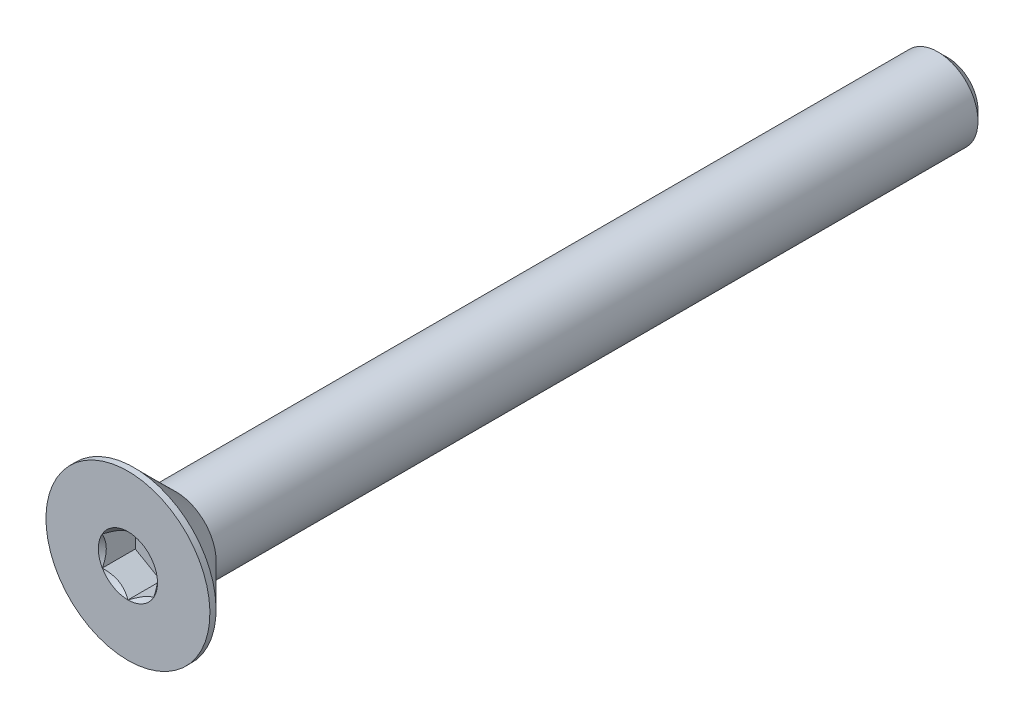
ISO-10303-21;
HEADER;
FILE_DESCRIPTION(('STEP AP214'),'2;1');
FILE_NAME('part.step','',(''),(''),'','','');
FILE_SCHEMA(('AUTOMOTIVE_DESIGN { 1 0 10303 214 1 1 1 1 }'));
ENDSEC;
DATA;
#1=APPLICATION_CONTEXT('core data for automotive mechanical design processes');
#2=APPLICATION_PROTOCOL_DEFINITION('international standard','automotive_design',2000,#1);
#3=PRODUCT_CONTEXT('',#1,'mechanical');
#4=PRODUCT('Part','Part','',(#3));
#5=PRODUCT_RELATED_PRODUCT_CATEGORY('part','',(#4));
#6=PRODUCT_DEFINITION_FORMATION('','',#4);
#7=PRODUCT_DEFINITION_CONTEXT('part definition',#1,'design');
#8=PRODUCT_DEFINITION('design','',#6,#7);
#9=PRODUCT_DEFINITION_SHAPE('','',#8);
#10=(LENGTH_UNIT() NAMED_UNIT(*) SI_UNIT(.MILLI.,.METRE.));
#11=(NAMED_UNIT(*) PLANE_ANGLE_UNIT() SI_UNIT($,.RADIAN.));
#12=(NAMED_UNIT(*) SI_UNIT($,.STERADIAN.) SOLID_ANGLE_UNIT());
#13=UNCERTAINTY_MEASURE_WITH_UNIT(LENGTH_MEASURE(1.E-05),#10,'distance_accuracy_value','');
#14=(GEOMETRIC_REPRESENTATION_CONTEXT(3) GLOBAL_UNCERTAINTY_ASSIGNED_CONTEXT((#13)) GLOBAL_UNIT_ASSIGNED_CONTEXT((#10,
#11,#12)) REPRESENTATION_CONTEXT('',''));
#15=CARTESIAN_POINT('',(0.,0.,0.));
#16=DIRECTION('',(0.,0.,1.));
#17=DIRECTION('',(1.,0.,0.));
#18=AXIS2_PLACEMENT_3D('',#15,#16,#17);
#19=CARTESIAN_POINT('',(1.25,-0.721687836487033,-1.61));
#20=DIRECTION('',(0.,0.,1.));
#21=DIRECTION('',(1.,0.,0.));
#22=AXIS2_PLACEMENT_3D('',#19,#20,#21);
#23=PLANE('',#22);
#24=DIRECTION('',(0.,1.,0.));
#25=VECTOR('',#24,1.);
#26=CARTESIAN_POINT('',(-1.25,0.721687836487033,-1.61));
#27=LINE('',#26,#25);
#28=CARTESIAN_POINT('',(-1.25,0.721687836487032,-1.61));
#29=VERTEX_POINT('',#28);
#30=CARTESIAN_POINT('',(-1.25,-0.721687836487031,-1.61));
#31=VERTEX_POINT('',#30);
#32=EDGE_CURVE('E83',#29,#31,#27,.F.);
#33=ORIENTED_EDGE('',*,*,#32,.T.);
#34=DIRECTION('',(0.866025403784439,-0.5,0.));
#35=VECTOR('',#34,1.);
#36=CARTESIAN_POINT('',(-1.25,-0.721687836487031,-1.61));
#37=LINE('',#36,#35);
#38=CARTESIAN_POINT('',(0.,-1.44337567297406,-1.61));
#39=VERTEX_POINT('',#38);
#40=EDGE_CURVE('E85',#31,#39,#37,.T.);
#41=ORIENTED_EDGE('',*,*,#40,.T.);
#42=DIRECTION('',(0.866025403784439,0.5,0.));
#43=VECTOR('',#42,1.);
#44=CARTESIAN_POINT('',(0.,-1.44337567297406,-1.61));
#45=LINE('',#44,#43);
#46=CARTESIAN_POINT('',(1.25,-0.721687836487033,-1.61));
#47=VERTEX_POINT('',#46);
#48=EDGE_CURVE('E86',#39,#47,#45,.T.);
#49=ORIENTED_EDGE('',*,*,#48,.T.);
#50=DIRECTION('',(0.,1.,0.));
#51=VECTOR('',#50,1.);
#52=CARTESIAN_POINT('',(1.25,-0.721687836487033,-1.61));
#53=LINE('',#52,#51);
#54=CARTESIAN_POINT('',(1.25,0.721687836487033,-1.61));
#55=VERTEX_POINT('',#54);
#56=EDGE_CURVE('E72',#47,#55,#53,.T.);
#57=ORIENTED_EDGE('',*,*,#56,.T.);
#58=DIRECTION('',(-0.866025403784439,0.5,0.));
#59=VECTOR('',#58,1.);
#60=CARTESIAN_POINT('',(1.25,0.721687836487033,-1.61));
#61=LINE('',#60,#59);
#62=CARTESIAN_POINT('',(0.,1.44337567297406,-1.61));
#63=VERTEX_POINT('',#62);
#64=EDGE_CURVE('E111',#55,#63,#61,.T.);
#65=ORIENTED_EDGE('',*,*,#64,.T.);
#66=DIRECTION('',(-0.866025403784439,-0.5,0.));
#67=VECTOR('',#66,1.);
#68=CARTESIAN_POINT('',(0.,1.44337567297406,-1.61));
#69=LINE('',#68,#67);
#70=EDGE_CURVE('E116',#63,#29,#69,.T.);
#71=ORIENTED_EDGE('',*,*,#70,.T.);
#72=EDGE_LOOP('',(#33,#41,#49,#57,#65,#71));
#73=FACE_BOUND('',#72,.T.);
#74=ADVANCED_FACE('F17',(#73),#23,.T.);
#75=CARTESIAN_POINT('',(0.,-1.44337567297406,-1.61));
#76=DIRECTION('',(0.5,-0.866025403784439,0.));
#77=DIRECTION('',(0.866025403784439,0.5,0.));
#78=AXIS2_PLACEMENT_3D('',#75,#76,#77);
#79=PLANE('',#78);
#80=CARTESIAN_POINT('',(-1.59632679260275E-12,-1.44337567297499,-2.26858532002141E-12));
#81=CARTESIAN_POINT('',(0.0429631084916685,-1.41857091072118,-0.0247809602853262));
#82=CARTESIAN_POINT('',(0.0866445640224962,-1.39335141061186,-0.048106250542211));
#83=CARTESIAN_POINT('',(0.175715534518587,-1.34192626181896,-0.0908138610995848));
#84=CARTESIAN_POINT('',(0.221113515509129,-1.3157157252734,-0.110172426663462));
#85=CARTESIAN_POINT('',(0.312656311401012,-1.26286346742285,-0.143333784117164));
#86=CARTESIAN_POINT('',(0.358777825771211,-1.23623519868579,-0.15721990325138));
#87=CARTESIAN_POINT('',(0.452035961001519,-1.18239258920645,-0.178614098245694));
#88=CARTESIAN_POINT('',(0.499169734949581,-1.15517989212961,-0.186138138130082));
#89=CARTESIAN_POINT('',(0.580409086338886,-1.1082763307362,-0.192927172266352));
#90=CARTESIAN_POINT('',(0.6144098218632,-1.0886459969286,-0.19393181141306));
#91=CARTESIAN_POINT('',(0.682351445146423,-1.04941988243685,-0.192236504858619));
#92=CARTESIAN_POINT('',(0.716292318027035,-1.02982411034269,-0.189535740825175));
#93=CARTESIAN_POINT('',(0.783846380048843,-0.990821754449551,-0.180585751756811));
#94=CARTESIAN_POINT('',(0.817459234875116,-0.97141536366737,-0.174333227052609));
#95=CARTESIAN_POINT('',(0.884123738991266,-0.932926594270518,-0.158616460881214));
#96=CARTESIAN_POINT('',(0.917175141068937,-0.91384435838388,-0.149150841277129));
#97=CARTESIAN_POINT('',(1.00178642984031,-0.864994008035248,-0.121071668556236));
#98=CARTESIAN_POINT('',(1.05281387539248,-0.835533298609642,-0.100350655055702));
#99=CARTESIAN_POINT('',(1.15287239429478,-0.777764485786684,-0.0536764942537954));
#100=CARTESIAN_POINT('',(1.20190935742265,-0.749452981924566,-0.0277403788128118));
#101=CARTESIAN_POINT('',(1.25000000000159,-0.721687836486111,-2.26874925040989E-12));
#102=B_SPLINE_CURVE_WITH_KNOTS('',3,(#80,#81,#82,#83,#84,#85,#86,#87,#88,#89,#90,#91,#92,#93,
#94,#95,#96,#97,#98,#99,#100,#101),.UNSPECIFIED.,.F.,.F.,(4,2,2,2,2,2,2,2,2,2,4),(0.,
0.166478683193945,0.333926926769032,0.498716658424013,0.663091654503517,0.780745575390526,
0.89842548413854,1.01621489951224,1.13405490022132,1.32111591628309,1.5075756576265),.UNSPECIFIED.);
#103=CARTESIAN_POINT('',(0.,-1.44337567297566,-1.5951974611112E-12));
#104=VERTEX_POINT('',#103);
#105=CARTESIAN_POINT('',(1.2500000000008,-0.721687836489762,-1.13440417118344E-12));
#106=VERTEX_POINT('',#105);
#107=EDGE_CURVE('E20',#104,#106,#102,.T.);
#108=ORIENTED_EDGE('',*,*,#107,.T.);
#109=DIRECTION('',(0.,0.,1.));
#110=VECTOR('',#109,1.);
#111=CARTESIAN_POINT('',(1.25,-0.721687836487033,-1.61));
#112=LINE('',#111,#110);
#113=EDGE_CURVE('E91',#106,#47,#112,.F.);
#114=ORIENTED_EDGE('',*,*,#113,.T.);
#115=ORIENTED_EDGE('',*,*,#48,.F.);
#116=DIRECTION('',(0.,0.,1.));
#117=VECTOR('',#116,1.);
#118=CARTESIAN_POINT('',(0.,-1.44337567297406,-1.61));
#119=LINE('',#118,#117);
#120=EDGE_CURVE('E59',#39,#104,#119,.T.);
#121=ORIENTED_EDGE('',*,*,#120,.T.);
#122=EDGE_LOOP('',(#108,#114,#115,#121));
#123=FACE_BOUND('',#122,.T.);
#124=ADVANCED_FACE('F90',(#123),#79,.F.);
#125=CARTESIAN_POINT('',(-1.25,-0.721687836487031,-1.61));
#126=DIRECTION('',(-0.5,-0.866025403784439,0.));
#127=DIRECTION('',(0.866025403784439,-0.5,0.));
#128=AXIS2_PLACEMENT_3D('',#125,#126,#127);
#129=PLANE('',#128);
#130=CARTESIAN_POINT('',(-1.2500000000016,-0.721687836486109,-2.26772922945651E-12));
#131=CARTESIAN_POINT('',(-1.20703689150833,-0.746492598739919,-0.0247809602853254));
#132=CARTESIAN_POINT('',(-1.1633554359775,-0.771712098849237,-0.0481062505422104));
#133=CARTESIAN_POINT('',(-1.07428446548141,-0.823137247642137,-0.0908138610995846));
#134=CARTESIAN_POINT('',(-1.02888648449087,-0.849347784187692,-0.110172426663462));
#135=CARTESIAN_POINT('',(-0.937343688598988,-0.902200042038241,-0.143333784117165));
#136=CARTESIAN_POINT('',(-0.891222174228788,-0.928828310775309,-0.15721990325138));
#137=CARTESIAN_POINT('',(-0.79796403899848,-0.98267092025465,-0.178614098245695));
#138=CARTESIAN_POINT('',(-0.750830265050418,-1.00988361733149,-0.186138138130082));
#139=CARTESIAN_POINT('',(-0.669590913661113,-1.05678717872489,-0.192927172266352));
#140=CARTESIAN_POINT('',(-0.635590178136799,-1.0764175125325,-0.193931811413061));
#141=CARTESIAN_POINT('',(-0.567648554853576,-1.11564362702425,-0.192236504858619));
#142=CARTESIAN_POINT('',(-0.533707681972964,-1.1352393991184,-0.189535740825175));
#143=CARTESIAN_POINT('',(-0.466153619951155,-1.17424175501155,-0.180585751756811));
#144=CARTESIAN_POINT('',(-0.432540765124883,-1.19364814579373,-0.174333227052609));
#145=CARTESIAN_POINT('',(-0.365876261008733,-1.23213691519058,-0.158616460881214));
#146=CARTESIAN_POINT('',(-0.332824858931062,-1.25121915107722,-0.149150841277129));
#147=CARTESIAN_POINT('',(-0.248213570159689,-1.30006950142585,-0.121071668556236));
#148=CARTESIAN_POINT('',(-0.197186124607517,-1.32953021085146,-0.100350655055702));
#149=CARTESIAN_POINT('',(-0.0971276057052169,-1.38729902367441,-0.0536764942537953));
#150=CARTESIAN_POINT('',(-0.0480906425773456,-1.41561052753653,-0.0277403788128117));
#151=CARTESIAN_POINT('',(1.59649182397064E-12,-1.44337567297499,-2.26862875383583E-12));
#152=B_SPLINE_CURVE_WITH_KNOTS('',3,(#130,#131,#132,#133,#134,#135,#136,#137,#138,#139,#140,
#141,#142,#143,#144,#145,#146,#147,#148,#149,#150,#151),.UNSPECIFIED.,.F.,.F.,(4,2,2,2,2,2,2,2,
2,2,4),(0.,0.166478683193946,0.333926926769033,0.498716658424015,0.66309165450352,
0.780745575390529,0.898425484138542,1.01621489951224,1.13405490022132,1.3211159162831,
1.5075756576265),.UNSPECIFIED.);
#153=CARTESIAN_POINT('',(-1.25000000000138,-0.721687836487828,-1.59464569232191E-12));
#154=VERTEX_POINT('',#153);
#155=EDGE_CURVE('E95',#154,#104,#152,.T.);
#156=ORIENTED_EDGE('',*,*,#155,.T.);
#157=ORIENTED_EDGE('',*,*,#120,.F.);
#158=ORIENTED_EDGE('',*,*,#40,.F.);
#159=DIRECTION('',(0.,0.,1.));
#160=VECTOR('',#159,1.);
#161=CARTESIAN_POINT('',(-1.25,-0.721687836487031,-1.61));
#162=LINE('',#161,#160);
#163=EDGE_CURVE('E97',#31,#154,#162,.T.);
#164=ORIENTED_EDGE('',*,*,#163,.T.);
#165=EDGE_LOOP('',(#156,#157,#158,#164));
#166=FACE_BOUND('',#165,.T.);
#167=ADVANCED_FACE('F93',(#166),#129,.F.);
#168=CARTESIAN_POINT('',(-1.25,0.721687836487033,-1.61));
#169=DIRECTION('',(-1.,0.,0.));
#170=DIRECTION('',(0.,0.,1.));
#171=AXIS2_PLACEMENT_3D('',#168,#169,#170);
#172=PLANE('',#171);
#173=CARTESIAN_POINT('',(-1.25,0.721687836488875,-2.26707204462826E-12));
#174=CARTESIAN_POINT('',(-1.25,0.672078311968734,-0.0247809602843515));
#175=CARTESIAN_POINT('',(-1.25,0.621639311737501,-0.0481062505397474));
#176=CARTESIAN_POINT('',(-1.25,0.518789014126518,-0.0908138610927559));
#177=CARTESIAN_POINT('',(-1.25,0.466367941022824,-0.110172426653753));
#178=CARTESIAN_POINT('',(-1.25,0.360663425297221,-0.143333784099995));
#179=CARTESIAN_POINT('',(-1.25,0.307406887811172,-0.157219903229681));
#180=CARTESIAN_POINT('',(-1.25,0.199721668829271,-0.178614098213361));
#181=CARTESIAN_POINT('',(-1.25,0.145296274664291,-0.186138138091645));
#182=CARTESIAN_POINT('',(-1.25,0.0514891518512712,-0.192927172217058));
#183=CARTESIAN_POINT('',(-1.25,0.0122284842208852,-0.19393181135857));
#184=CARTESIAN_POINT('',(-1.25,-0.0662237447923836,-0.19223650479206));
#185=CARTESIAN_POINT('',(-1.25,-0.10541528899529,-0.189535740751741));
#186=CARTESIAN_POINT('',(-1.25,-0.183420000810115,-0.180585751668415));
#187=CARTESIAN_POINT('',(-1.25,-0.222232782388411,-0.174333226956124));
#188=CARTESIAN_POINT('',(-1.25,-0.299210321209361,-0.158616460767832));
#189=CARTESIAN_POINT('',(-1.25,-0.337374792995946,-0.14915084115494));
#190=CARTESIAN_POINT('',(-1.25,-0.43507549364919,-0.121071668433227));
#191=CARTESIAN_POINT('',(-1.25,-0.493996912445358,-0.100350654949517));
#192=CARTESIAN_POINT('',(-1.25,-0.609534537985813,-0.0536764941931683));
#193=CARTESIAN_POINT('',(-1.25,-0.66615754565963,-0.0277403787809137));
#194=CARTESIAN_POINT('',(-1.25,-0.721687836488873,-2.26787846144495E-12));
#195=B_SPLINE_CURVE_WITH_KNOTS('',3,(#173,#174,#175,#176,#177,#178,#179,#180,#181,#182,#183,
#184,#185,#186,#187,#188,#189,#190,#191,#192,#193,#194),.UNSPECIFIED.,.F.,.F.,(4,2,2,2,2,2,2,2,
2,2,4),(0.,0.166478683226287,0.333926926833723,0.498716658519756,0.663091654630285,
0.780745575562284,0.89842548435534,1.01621489977414,1.13405490052833,1.3211159164188,
1.50757565759031),.UNSPECIFIED.);
#196=CARTESIAN_POINT('',(-1.25000000000138,0.72168783648783,-1.59446391689966E-12));
#197=VERTEX_POINT('',#196);
#198=EDGE_CURVE('E195',#197,#154,#195,.T.);
#199=ORIENTED_EDGE('',*,*,#198,.T.);
#200=ORIENTED_EDGE('',*,*,#163,.F.);
#201=ORIENTED_EDGE('',*,*,#32,.F.);
#202=DIRECTION('',(0.,0.,1.));
#203=VECTOR('',#202,1.);
#204=CARTESIAN_POINT('',(-1.25,0.721687836487032,-1.61));
#205=LINE('',#204,#203);
#206=EDGE_CURVE('E113',#29,#197,#205,.T.);
#207=ORIENTED_EDGE('',*,*,#206,.T.);
#208=EDGE_LOOP('',(#199,#200,#201,#207));
#209=FACE_BOUND('',#208,.T.);
#210=ADVANCED_FACE('F205',(#209),#172,.F.);
#211=CARTESIAN_POINT('',(0.,1.44337567297406,-1.61));
#212=DIRECTION('',(-0.5,0.866025403784439,0.));
#213=DIRECTION('',(-0.866025403784439,-0.5,0.));
#214=AXIS2_PLACEMENT_3D('',#211,#212,#213);
#215=PLANE('',#214);
#216=CARTESIAN_POINT('',(1.59613436319943E-12,1.44337567297499,-2.26833909628074E-12));
#217=CARTESIAN_POINT('',(-0.0429631084916687,1.41857091072118,-0.024780960285326));
#218=CARTESIAN_POINT('',(-0.0866445640224964,1.39335141061186,-0.0481062505422108));
#219=CARTESIAN_POINT('',(-0.175715534518587,1.34192626181896,-0.0908138610995847));
#220=CARTESIAN_POINT('',(-0.22111351550913,1.3157157252734,-0.110172426663462));
#221=CARTESIAN_POINT('',(-0.312656311401012,1.26286346742285,-0.143333784117164));
#222=CARTESIAN_POINT('',(-0.358777825771212,1.23623519868579,-0.15721990325138));
#223=CARTESIAN_POINT('',(-0.45203596100152,1.18239258920645,-0.178614098245694));
#224=CARTESIAN_POINT('',(-0.499169734949581,1.15517989212961,-0.186138138130082));
#225=CARTESIAN_POINT('',(-0.580409086338886,1.1082763307362,-0.192927172266352));
#226=CARTESIAN_POINT('',(-0.6144098218632,1.0886459969286,-0.19393181141306));
#227=CARTESIAN_POINT('',(-0.682351445146423,1.04941988243685,-0.192236504858619));
#228=CARTESIAN_POINT('',(-0.716292318027036,1.02982411034269,-0.189535740825175));
#229=CARTESIAN_POINT('',(-0.783846380048844,0.99082175444955,-0.180585751756811));
#230=CARTESIAN_POINT('',(-0.817459234875117,0.97141536366737,-0.174333227052609));
#231=CARTESIAN_POINT('',(-0.884123738991267,0.932926594270518,-0.158616460881213));
#232=CARTESIAN_POINT('',(-0.917175141068938,0.91384435838388,-0.149150841277128));
#233=CARTESIAN_POINT('',(-1.00178642984031,0.864994008035247,-0.121071668556235));
#234=CARTESIAN_POINT('',(-1.05281387539248,0.835533298609641,-0.100350655055701));
#235=CARTESIAN_POINT('',(-1.15287239429478,0.777764485786683,-0.0536764942537944));
#236=CARTESIAN_POINT('',(-1.20190935742265,0.749452981924565,-0.0277403788128108));
#237=CARTESIAN_POINT('',(-1.2500000000016,0.721687836486111,-2.26788103424833E-12));
#238=B_SPLINE_CURVE_WITH_KNOTS('',3,(#216,#217,#218,#219,#220,#221,#222,#223,#224,#225,#226,
#227,#228,#229,#230,#231,#232,#233,#234,#235,#236,#237),.UNSPECIFIED.,.F.,.F.,(4,2,2,2,2,2,2,2,
2,2,4),(0.,0.166478683193945,0.333926926769032,0.498716658424013,0.663091654503518,
0.780745575390527,0.898425484138541,1.01621489951224,1.13405490022132,1.3211159162831,
1.5075756576265),.UNSPECIFIED.);
#239=CARTESIAN_POINT('',(0.,1.44337567297566,-1.59483068508603E-12));
#240=VERTEX_POINT('',#239);
#241=EDGE_CURVE('E187',#240,#197,#238,.T.);
#242=ORIENTED_EDGE('',*,*,#241,.T.);
#243=ORIENTED_EDGE('',*,*,#206,.F.);
#244=ORIENTED_EDGE('',*,*,#70,.F.);
#245=DIRECTION('',(0.,0.,1.));
#246=VECTOR('',#245,1.);
#247=CARTESIAN_POINT('',(0.,1.44337567297406,-1.61));
#248=LINE('',#247,#246);
#249=EDGE_CURVE('E108',#63,#240,#248,.T.);
#250=ORIENTED_EDGE('',*,*,#249,.T.);
#251=EDGE_LOOP('',(#242,#243,#244,#250));
#252=FACE_BOUND('',#251,.T.);
#253=ADVANCED_FACE('F201',(#252),#215,.F.);
#254=CARTESIAN_POINT('',(1.25,0.721687836487033,-1.61));
#255=DIRECTION('',(0.5,0.866025403784439,0.));
#256=DIRECTION('',(-0.866025403784439,0.5,0.));
#257=AXIS2_PLACEMENT_3D('',#254,#255,#256);
#258=PLANE('',#257);
#259=CARTESIAN_POINT('',(1.2500000000016,0.721687836486112,-2.26853709977727E-12));
#260=CARTESIAN_POINT('',(1.20703689150833,0.746492598739921,-0.0247809602853261));
#261=CARTESIAN_POINT('',(1.1633554359775,0.771712098849239,-0.0481062505422108));
#262=CARTESIAN_POINT('',(1.07428446548141,0.823137247642138,-0.0908138610995846));
#263=CARTESIAN_POINT('',(1.02888648449087,0.849347784187693,-0.110172426663462));
#264=CARTESIAN_POINT('',(0.937343688598987,0.902200042038243,-0.143333784117164));
#265=CARTESIAN_POINT('',(0.891222174228788,0.92882831077531,-0.15721990325138));
#266=CARTESIAN_POINT('',(0.79796403899848,0.982670920254651,-0.178614098245694));
#267=CARTESIAN_POINT('',(0.750830265050419,1.00988361733149,-0.186138138130081));
#268=CARTESIAN_POINT('',(0.669590913661114,1.05678717872489,-0.192927172266351));
#269=CARTESIAN_POINT('',(0.6355901781368,1.0764175125325,-0.19393181141306));
#270=CARTESIAN_POINT('',(0.567648554853577,1.11564362702425,-0.192236504858619));
#271=CARTESIAN_POINT('',(0.533707681972964,1.1352393991184,-0.189535740825174));
#272=CARTESIAN_POINT('',(0.466153619951156,1.17424175501155,-0.180585751756811));
#273=CARTESIAN_POINT('',(0.432540765124883,1.19364814579373,-0.174333227052609));
#274=CARTESIAN_POINT('',(0.365876261008733,1.23213691519058,-0.158616460881213));
#275=CARTESIAN_POINT('',(0.332824858931062,1.25121915107722,-0.149150841277128));
#276=CARTESIAN_POINT('',(0.24821357015969,1.30006950142585,-0.121071668556235));
#277=CARTESIAN_POINT('',(0.197186124607517,1.32953021085146,-0.100350655055702));
#278=CARTESIAN_POINT('',(0.0971276057052174,1.38729902367441,-0.0536764942537946));
#279=CARTESIAN_POINT('',(0.0480906425773461,1.41561052753653,-0.0277403788128111));
#280=CARTESIAN_POINT('',(-1.59614565415006E-12,1.44337567297499,-2.26815881940463E-12));
#281=B_SPLINE_CURVE_WITH_KNOTS('',3,(#259,#260,#261,#262,#263,#264,#265,#266,#267,#268,#269,
#270,#271,#272,#273,#274,#275,#276,#277,#278,#279,#280),.UNSPECIFIED.,.F.,.F.,(4,2,2,2,2,2,2,2,
2,2,4),(0.,0.166478683193945,0.333926926769031,0.498716658424013,0.663091654503516,
0.780745575390525,0.898425484138539,1.01621489951224,1.13405490022132,1.32111591628309,
1.5075756576265),.UNSPECIFIED.);
#282=CARTESIAN_POINT('',(1.25000000000138,0.721687836487831,-1.59505075853978E-12));
#283=VERTEX_POINT('',#282);
#284=EDGE_CURVE('E157',#283,#240,#281,.T.);
#285=ORIENTED_EDGE('',*,*,#284,.T.);
#286=ORIENTED_EDGE('',*,*,#249,.F.);
#287=ORIENTED_EDGE('',*,*,#64,.F.);
#288=DIRECTION('',(0.,0.,1.));
#289=VECTOR('',#288,1.);
#290=CARTESIAN_POINT('',(1.25,0.721687836487033,-1.61));
#291=LINE('',#290,#289);
#292=EDGE_CURVE('E40',#55,#283,#291,.T.);
#293=ORIENTED_EDGE('',*,*,#292,.T.);
#294=EDGE_LOOP('',(#285,#286,#287,#293));
#295=FACE_BOUND('',#294,.T.);
#296=ADVANCED_FACE('F204',(#295),#258,.F.);
#297=CARTESIAN_POINT('',(1.25,-0.721687836487033,-1.61));
#298=DIRECTION('',(1.,0.,0.));
#299=DIRECTION('',(0.,1.,0.));
#300=AXIS2_PLACEMENT_3D('',#297,#298,#299);
#301=PLANE('',#300);
#302=CARTESIAN_POINT('',(1.25,-0.721687836488877,-2.26868472484918E-12));
#303=CARTESIAN_POINT('',(1.25,-0.672078311968736,-0.0247809602843533));
#304=CARTESIAN_POINT('',(1.25,-0.621639311737502,-0.0481062505397492));
#305=CARTESIAN_POINT('',(1.25,-0.51878901412652,-0.0908138610927579));
#306=CARTESIAN_POINT('',(1.25,-0.466367941022825,-0.110172426653756));
#307=CARTESIAN_POINT('',(1.25,-0.360663425297223,-0.143333784099998));
#308=CARTESIAN_POINT('',(1.25,-0.307406887811173,-0.157219903229684));
#309=CARTESIAN_POINT('',(1.25,-0.199721668829271,-0.178614098213363));
#310=CARTESIAN_POINT('',(1.25,-0.145296274664292,-0.186138138091648));
#311=CARTESIAN_POINT('',(1.25,-0.0514891518512717,-0.19292717221706));
#312=CARTESIAN_POINT('',(1.25,-0.0122284842208858,-0.193931811358573));
#313=CARTESIAN_POINT('',(1.25,0.0662237447923829,-0.192236504792063));
#314=CARTESIAN_POINT('',(1.25,0.105415288995289,-0.189535740751744));
#315=CARTESIAN_POINT('',(1.25,0.183420000810114,-0.180585751668418));
#316=CARTESIAN_POINT('',(1.25,0.22223278238841,-0.174333226956126));
#317=CARTESIAN_POINT('',(1.25,0.299210321209359,-0.158616460767835));
#318=CARTESIAN_POINT('',(1.25,0.337374792995945,-0.149150841154943));
#319=CARTESIAN_POINT('',(1.25,0.43507549364919,-0.121071668433229));
#320=CARTESIAN_POINT('',(1.25,0.493996912445358,-0.100350654949519));
#321=CARTESIAN_POINT('',(1.25,0.609534537985814,-0.0536764941931697));
#322=CARTESIAN_POINT('',(1.25,0.666157545659632,-0.0277403787809148));
#323=CARTESIAN_POINT('',(1.25,0.721687836488876,-2.26852812832509E-12));
#324=B_SPLINE_CURVE_WITH_KNOTS('',3,(#302,#303,#304,#305,#306,#307,#308,#309,#310,#311,#312,
#313,#314,#315,#316,#317,#318,#319,#320,#321,#322,#323),.UNSPECIFIED.,.F.,.F.,(4,2,2,2,2,2,2,2,
2,2,4),(0.,0.166478683226287,0.333926926833724,0.498716658519757,0.663091654630287,
0.780745575562285,0.898425484355342,1.01621489977414,1.13405490052833,1.3211159164188,
1.50757565759032),.UNSPECIFIED.);
#325=EDGE_CURVE('E149',#106,#283,#324,.T.);
#326=ORIENTED_EDGE('',*,*,#325,.T.);
#327=ORIENTED_EDGE('',*,*,#292,.F.);
#328=ORIENTED_EDGE('',*,*,#56,.F.);
#329=ORIENTED_EDGE('',*,*,#113,.F.);
#330=EDGE_LOOP('',(#326,#327,#328,#329));
#331=FACE_BOUND('',#330,.T.);
#332=ADVANCED_FACE('F165',(#331),#301,.F.);
#333=CARTESIAN_POINT('',(0.,0.,-5.6843418860808E-11));
#334=DIRECTION('',(0.,0.,1.));
#335=DIRECTION('',(1.,0.,0.));
#336=AXIS2_PLACEMENT_3D('',#333,#334,#335);
#337=CONICAL_SURFACE('',#336,1.44337567292041,0.78539816325135);
#338=ORIENTED_EDGE('',*,*,#107,.F.);
#339=CARTESIAN_POINT('',(0.,0.,0.));
#340=DIRECTION('',(0.,0.,1.));
#341=DIRECTION('',(1.,0.,0.));
#342=AXIS2_PLACEMENT_3D('',#339,#340,#341);
#343=CIRCLE('',#342,1.44337567297725);
#344=EDGE_CURVE('E146',#106,#104,#343,.F.);
#345=ORIENTED_EDGE('',*,*,#344,.F.);
#346=EDGE_LOOP('',(#338,#345));
#347=FACE_BOUND('',#346,.T.);
#348=ADVANCED_FACE('F222',(#347),#337,.F.);
#349=CARTESIAN_POINT('',(0.,0.,-5.6843418860808E-11));
#350=DIRECTION('',(0.,0.,1.));
#351=DIRECTION('',(1.,0.,0.));
#352=AXIS2_PLACEMENT_3D('',#349,#350,#351);
#353=CONICAL_SURFACE('',#352,1.44337567292041,0.78539816325135);
#354=ORIENTED_EDGE('',*,*,#155,.F.);
#355=CARTESIAN_POINT('',(0.,0.,0.));
#356=DIRECTION('',(0.,0.,1.));
#357=DIRECTION('',(1.,0.,0.));
#358=AXIS2_PLACEMENT_3D('',#355,#356,#357);
#359=CIRCLE('',#358,1.44337567297725);
#360=EDGE_CURVE('E143',#104,#154,#359,.F.);
#361=ORIENTED_EDGE('',*,*,#360,.F.);
#362=EDGE_LOOP('',(#354,#361));
#363=FACE_BOUND('',#362,.T.);
#364=ADVANCED_FACE('F219',(#363),#353,.F.);
#365=CARTESIAN_POINT('',(0.,0.,-5.6843418860808E-11));
#366=DIRECTION('',(0.,0.,1.));
#367=DIRECTION('',(1.,0.,0.));
#368=AXIS2_PLACEMENT_3D('',#365,#366,#367);
#369=CONICAL_SURFACE('',#368,1.44337567292041,0.785398163397448);
#370=ORIENTED_EDGE('',*,*,#198,.F.);
#371=CARTESIAN_POINT('',(0.,0.,0.));
#372=DIRECTION('',(0.,0.,1.));
#373=DIRECTION('',(1.,0.,0.));
#374=AXIS2_PLACEMENT_3D('',#371,#372,#373);
#375=CIRCLE('',#374,1.44337567297725);
#376=EDGE_CURVE('E140',#154,#197,#375,.F.);
#377=ORIENTED_EDGE('',*,*,#376,.F.);
#378=EDGE_LOOP('',(#370,#377));
#379=FACE_BOUND('',#378,.T.);
#380=ADVANCED_FACE('F183',(#379),#369,.F.);
#381=CARTESIAN_POINT('',(0.,0.,-5.6843418860808E-11));
#382=DIRECTION('',(0.,0.,1.));
#383=DIRECTION('',(1.,0.,0.));
#384=AXIS2_PLACEMENT_3D('',#381,#382,#383);
#385=CONICAL_SURFACE('',#384,1.44337567292041,0.78539816325135);
#386=ORIENTED_EDGE('',*,*,#241,.F.);
#387=CARTESIAN_POINT('',(0.,0.,0.));
#388=DIRECTION('',(0.,0.,1.));
#389=DIRECTION('',(1.,0.,0.));
#390=AXIS2_PLACEMENT_3D('',#387,#388,#389);
#391=CIRCLE('',#390,1.44337567297725);
#392=EDGE_CURVE('E137',#197,#240,#391,.F.);
#393=ORIENTED_EDGE('',*,*,#392,.F.);
#394=EDGE_LOOP('',(#386,#393));
#395=FACE_BOUND('',#394,.T.);
#396=ADVANCED_FACE('F178',(#395),#385,.F.);
#397=CARTESIAN_POINT('',(0.,0.,-5.6843418860808E-11));
#398=DIRECTION('',(0.,0.,1.));
#399=DIRECTION('',(1.,0.,0.));
#400=AXIS2_PLACEMENT_3D('',#397,#398,#399);
#401=CONICAL_SURFACE('',#400,1.44337567292041,0.78539816325135);
#402=ORIENTED_EDGE('',*,*,#284,.F.);
#403=CARTESIAN_POINT('',(0.,0.,0.));
#404=DIRECTION('',(0.,0.,1.));
#405=DIRECTION('',(1.,0.,0.));
#406=AXIS2_PLACEMENT_3D('',#403,#404,#405);
#407=CIRCLE('',#406,1.44337567297725);
#408=EDGE_CURVE('E134',#240,#283,#407,.F.);
#409=ORIENTED_EDGE('',*,*,#408,.F.);
#410=EDGE_LOOP('',(#402,#409));
#411=FACE_BOUND('',#410,.T.);
#412=ADVANCED_FACE('F172',(#411),#401,.F.);
#413=CARTESIAN_POINT('',(0.,0.,-5.6843418860808E-11));
#414=DIRECTION('',(0.,0.,1.));
#415=DIRECTION('',(1.,0.,0.));
#416=AXIS2_PLACEMENT_3D('',#413,#414,#415);
#417=CONICAL_SURFACE('',#416,1.44337567292041,0.785398163397448);
#418=CARTESIAN_POINT('',(0.,0.,0.));
#419=DIRECTION('',(0.,0.,1.));
#420=DIRECTION('',(1.,0.,0.));
#421=AXIS2_PLACEMENT_3D('',#418,#419,#420);
#422=CIRCLE('',#421,1.44337567297725);
#423=EDGE_CURVE('E131',#283,#106,#422,.F.);
#424=ORIENTED_EDGE('',*,*,#423,.F.);
#425=ORIENTED_EDGE('',*,*,#325,.F.);
#426=EDGE_LOOP('',(#424,#425));
#427=FACE_BOUND('',#426,.T.);
#428=ADVANCED_FACE('F167',(#427),#417,.F.);
#429=CARTESIAN_POINT('',(0.,-2.,0.));
#430=DIRECTION('',(0.,0.,1.));
#431=DIRECTION('',(0.,-1.,0.));
#432=AXIS2_PLACEMENT_3D('',#429,#430,#431);
#433=PLANE('',#432);
#434=ORIENTED_EDGE('',*,*,#408,.T.);
#435=ORIENTED_EDGE('',*,*,#423,.T.);
#436=ORIENTED_EDGE('',*,*,#344,.T.);
#437=ORIENTED_EDGE('',*,*,#360,.T.);
#438=ORIENTED_EDGE('',*,*,#376,.T.);
#439=ORIENTED_EDGE('',*,*,#392,.T.);
#440=EDGE_LOOP('',(#434,#435,#436,#437,#438,#439));
#441=FACE_BOUND('',#440,.T.);
#442=CARTESIAN_POINT('',(0.,0.,0.));
#443=DIRECTION('',(0.,0.,1.));
#444=DIRECTION('',(0.,-1.,0.));
#445=AXIS2_PLACEMENT_3D('',#442,#443,#444);
#446=CIRCLE('',#445,4.);
#447=CARTESIAN_POINT('',(0.,-4.,0.));
#448=VERTEX_POINT('',#447);
#449=EDGE_CURVE('E128',#448,#448,#446,.F.);
#450=ORIENTED_EDGE('',*,*,#449,.F.);
#451=EDGE_LOOP('',(#450));
#452=FACE_BOUND('',#451,.T.);
#453=ADVANCED_FACE('F171',(#441,#452),#433,.T.);
#454=CARTESIAN_POINT('',(0.,-2.,-40.));
#455=DIRECTION('',(0.,0.,-1.));
#456=DIRECTION('',(0.,1.,0.));
#457=AXIS2_PLACEMENT_3D('',#454,#455,#456);
#458=PLANE('',#457);
#459=CARTESIAN_POINT('',(0.,0.,-39.9999999999636));
#460=DIRECTION('',(0.,0.,1.));
#461=DIRECTION('',(1.,0.,0.));
#462=AXIS2_PLACEMENT_3D('',#459,#460,#461);
#463=CIRCLE('',#462,1.47499999997081);
#464=CARTESIAN_POINT('',(1.47499999997081,0.,-39.9999999999636));
#465=VERTEX_POINT('',#464);
#466=EDGE_CURVE('E124',#465,#465,#463,.T.);
#467=ORIENTED_EDGE('',*,*,#466,.F.);
#468=EDGE_LOOP('',(#467));
#469=FACE_BOUND('',#468,.T.);
#470=ADVANCED_FACE('F250',(#469),#458,.T.);
#471=CARTESIAN_POINT('',(0.,0.,0.));
#472=DIRECTION('',(0.,0.,1.));
#473=DIRECTION('',(0.,-1.,0.));
#474=AXIS2_PLACEMENT_3D('',#471,#472,#473);
#475=CYLINDRICAL_SURFACE('',#474,4.);
#476=CARTESIAN_POINT('',(0.,0.,-0.299999999981541));
#477=DIRECTION('',(0.,0.,1.));
#478=DIRECTION('',(0.,-1.,0.));
#479=AXIS2_PLACEMENT_3D('',#476,#477,#478);
#480=CIRCLE('',#479,4.0000000000191);
#481=CARTESIAN_POINT('',(0.,-4.0000000000191,-0.299999999981537));
#482=VERTEX_POINT('',#481);
#483=EDGE_CURVE('E127',#482,#482,#480,.F.);
#484=ORIENTED_EDGE('',*,*,#483,.F.);
#485=EDGE_LOOP('',(#484));
#486=FACE_BOUND('',#485,.T.);
#487=ORIENTED_EDGE('',*,*,#449,.T.);
#488=EDGE_LOOP('',(#487));
#489=FACE_BOUND('',#488,.T.);
#490=ADVANCED_FACE('F247',(#486,#489),#475,.T.);
#491=CARTESIAN_POINT('',(0.,0.,-39.5209999999793));
#492=DIRECTION('',(0.,0.,1.));
#493=DIRECTION('',(1.,0.,0.));
#494=AXIS2_PLACEMENT_3D('',#491,#492,#493);
#495=CONICAL_SURFACE('',#494,1.95399999995516,0.785398163397448);
#496=CARTESIAN_POINT('',(0.,0.,-39.5209999999999));
#497=DIRECTION('',(0.,0.,-1.));
#498=DIRECTION('',(0.,1.,0.));
#499=AXIS2_PLACEMENT_3D('',#496,#497,#498);
#500=CIRCLE('',#499,1.954);
#501=CARTESIAN_POINT('',(0.,1.954,-39.5209999999999));
#502=VERTEX_POINT('',#501);
#503=EDGE_CURVE('E31',#502,#502,#500,.F.);
#504=ORIENTED_EDGE('',*,*,#503,.F.);
#505=EDGE_LOOP('',(#504));
#506=FACE_BOUND('',#505,.T.);
#507=ORIENTED_EDGE('',*,*,#466,.T.);
#508=EDGE_LOOP('',(#507));
#509=FACE_BOUND('',#508,.T.);
#510=ADVANCED_FACE('F240',(#506,#509),#495,.T.);
#511=CARTESIAN_POINT('',(0.,0.,-0.299999999924697));
#512=DIRECTION('',(0.,0.,1.));
#513=DIRECTION('',(0.,-1.,0.));
#514=AXIS2_PLACEMENT_3D('',#511,#512,#513);
#515=CONICAL_SURFACE('',#514,4.00000000007594,0.785398163397449);
#516=CARTESIAN_POINT('',(0.,0.,-2.346));
#517=DIRECTION('',(0.,0.,-1.));
#518=DIRECTION('',(0.,1.,0.));
#519=AXIS2_PLACEMENT_3D('',#516,#517,#518);
#520=CIRCLE('',#519,1.954);
#521=CARTESIAN_POINT('',(0.,1.954,-2.346));
#522=VERTEX_POINT('',#521);
#523=EDGE_CURVE('E11',#522,#522,#520,.T.);
#524=ORIENTED_EDGE('',*,*,#523,.F.);
#525=EDGE_LOOP('',(#524));
#526=FACE_BOUND('',#525,.T.);
#527=ORIENTED_EDGE('',*,*,#483,.T.);
#528=EDGE_LOOP('',(#527));
#529=FACE_BOUND('',#528,.T.);
#530=ADVANCED_FACE('F234',(#526,#529),#515,.T.);
#531=CARTESIAN_POINT('',(0.,0.,-40.));
#532=DIRECTION('',(0.,0.,-1.));
#533=DIRECTION('',(0.,1.,0.));
#534=AXIS2_PLACEMENT_3D('',#531,#532,#533);
#535=CYLINDRICAL_SURFACE('',#534,1.954);
#536=ORIENTED_EDGE('',*,*,#523,.T.);
#537=EDGE_LOOP('',(#536));
#538=FACE_BOUND('',#537,.T.);
#539=ORIENTED_EDGE('',*,*,#503,.T.);
#540=EDGE_LOOP('',(#539));
#541=FACE_BOUND('',#540,.T.);
#542=ADVANCED_FACE('F232',(#538,#541),#535,.T.);
#543=CLOSED_SHELL('',(#74,#124,#167,#210,#253,#296,#332,#348,#364,#380,#396,#412,#428,#453,#470,
#490,#510,#530,#542));
#544=MANIFOLD_SOLID_BREP('B1',#543);
#545=ADVANCED_BREP_SHAPE_REPRESENTATION('',(#18,#544),#14);
#546=SHAPE_DEFINITION_REPRESENTATION(#9,#545);
ENDSEC;
END-ISO-10303-21;
